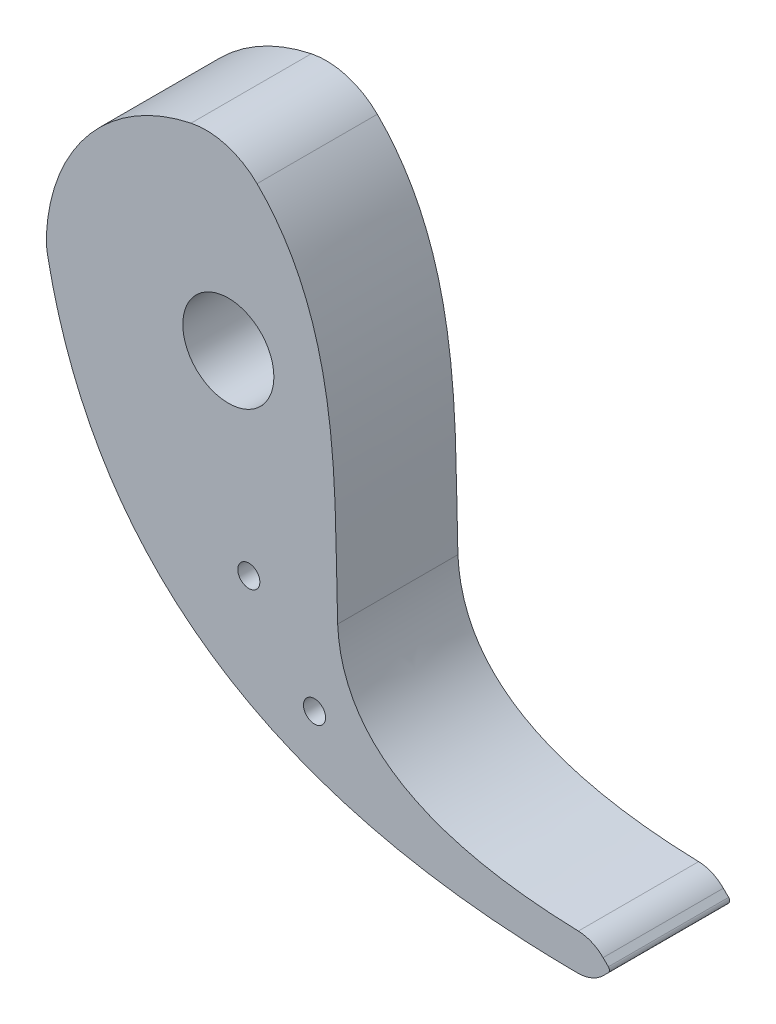
ISO-10303-21;
HEADER;
FILE_DESCRIPTION(('STEP AP214'),'2;1');
FILE_NAME('part.step','',(''),(''),'','','');
FILE_SCHEMA(('AUTOMOTIVE_DESIGN { 1 0 10303 214 1 1 1 1 }'));
ENDSEC;
DATA;
#1=APPLICATION_CONTEXT('core data for automotive mechanical design processes');
#2=APPLICATION_PROTOCOL_DEFINITION('international standard','automotive_design',2000,#1);
#3=PRODUCT_CONTEXT('',#1,'mechanical');
#4=PRODUCT('Part','Part','',(#3));
#5=PRODUCT_RELATED_PRODUCT_CATEGORY('part','',(#4));
#6=PRODUCT_DEFINITION_FORMATION('','',#4);
#7=PRODUCT_DEFINITION_CONTEXT('part definition',#1,'design');
#8=PRODUCT_DEFINITION('design','',#6,#7);
#9=PRODUCT_DEFINITION_SHAPE('','',#8);
#10=(LENGTH_UNIT() NAMED_UNIT(*) SI_UNIT(.MILLI.,.METRE.));
#11=(NAMED_UNIT(*) PLANE_ANGLE_UNIT() SI_UNIT($,.RADIAN.));
#12=(NAMED_UNIT(*) SI_UNIT($,.STERADIAN.) SOLID_ANGLE_UNIT());
#13=UNCERTAINTY_MEASURE_WITH_UNIT(LENGTH_MEASURE(1.E-05),#10,'distance_accuracy_value','');
#14=(GEOMETRIC_REPRESENTATION_CONTEXT(3) GLOBAL_UNCERTAINTY_ASSIGNED_CONTEXT((#13)) GLOBAL_UNIT_ASSIGNED_CONTEXT((#10,
#11,#12)) REPRESENTATION_CONTEXT('',''));
#15=CARTESIAN_POINT('',(0.,0.,0.));
#16=DIRECTION('',(0.,0.,1.));
#17=DIRECTION('',(1.,0.,0.));
#18=AXIS2_PLACEMENT_3D('',#15,#16,#17);
#19=CARTESIAN_POINT('',(96.0614321255408,-89.9222344491999,100.));
#20=CARTESIAN_POINT('',(74.6396324890567,-89.3105921557209,100.));
#21=CARTESIAN_POINT('',(42.207594165123,-82.0452441207387,100.));
#22=CARTESIAN_POINT('',(30.5986777387312,-62.6957691895991,100.));
#23=CARTESIAN_POINT('',(30.,-50.,100.));
#24=B_SPLINE_CURVE_WITH_KNOTS('',3,(#19,#20,#21,#22,#23),.UNSPECIFIED.,.F.,.F.,(4,1,4),
(0.0277647284146162,0.487449893921152,0.947135059427687),.UNSPECIFIED.);
#25=DIRECTION('',(0.,0.,-1.));
#26=VECTOR('',#25,1.);
#27=SURFACE_OF_LINEAR_EXTRUSION('',#24,#26);
#28=DIRECTION('',(0.,0.,-1.));
#29=VECTOR('',#28,1.);
#30=CARTESIAN_POINT('',(96.0614321255408,-89.9222344491999,100.));
#31=LINE('',#30,#29);
#32=CARTESIAN_POINT('',(96.0614321255408,-89.9222344491999,100.));
#33=VERTEX_POINT('',#32);
#34=CARTESIAN_POINT('',(96.0614321255408,-89.9222344491999,67.));
#35=VERTEX_POINT('',#34);
#36=EDGE_CURVE('E142',#33,#35,#31,.T.);
#37=ORIENTED_EDGE('',*,*,#36,.T.);
#38=CARTESIAN_POINT('',(96.0614321255408,-89.9222344491999,67.));
#39=CARTESIAN_POINT('',(74.6396324890567,-89.3105921557209,67.));
#40=CARTESIAN_POINT('',(42.207594165123,-82.0452441207387,67.));
#41=CARTESIAN_POINT('',(30.5986777387312,-62.6957691895991,67.));
#42=CARTESIAN_POINT('',(30.,-50.,67.));
#43=B_SPLINE_CURVE_WITH_KNOTS('',3,(#38,#39,#40,#41,#42),.UNSPECIFIED.,.F.,.F.,(4,1,4),
(0.0277647284146162,0.487449893921152,0.947135059427687),.UNSPECIFIED.);
#44=CARTESIAN_POINT('',(30.,-50.,67.));
#45=VERTEX_POINT('',#44);
#46=EDGE_CURVE('E54',#35,#45,#43,.T.);
#47=ORIENTED_EDGE('',*,*,#46,.T.);
#48=DIRECTION('',(0.,0.,-1.));
#49=VECTOR('',#48,1.);
#50=CARTESIAN_POINT('',(30.,-50.,100.));
#51=LINE('',#50,#49);
#52=CARTESIAN_POINT('',(30.,-50.,100.));
#53=VERTEX_POINT('',#52);
#54=EDGE_CURVE('E11',#53,#45,#51,.T.);
#55=ORIENTED_EDGE('',*,*,#54,.F.);
#56=EDGE_CURVE('E218',#33,#53,#24,.T.);
#57=ORIENTED_EDGE('',*,*,#56,.F.);
#58=EDGE_LOOP('',(#37,#47,#55,#57));
#59=FACE_BOUND('',#58,.T.);
#60=ADVANCED_FACE('F37',(#59),#27,.F.);
#61=CARTESIAN_POINT('',(30.,-50.,100.));
#62=CARTESIAN_POINT('',(29.0655778584205,-23.9165926404982,100.));
#63=CARTESIAN_POINT('',(31.4518831291268,15.3536689120195,100.));
#64=CARTESIAN_POINT('',(10.553539900454,41.0011969030345,100.));
#65=CARTESIAN_POINT('',(7.88775097032687,43.6234763854406,100.));
#66=B_SPLINE_CURVE_WITH_KNOTS('',3,(#61,#62,#63,#64,#65),.UNSPECIFIED.,.F.,.F.,(4,1,4),(0.,
0.805376888640356,0.908560602925233),.UNSPECIFIED.);
#67=DIRECTION('',(0.,0.,-1.));
#68=VECTOR('',#67,1.);
#69=SURFACE_OF_LINEAR_EXTRUSION('',#66,#68);
#70=ORIENTED_EDGE('',*,*,#54,.T.);
#71=CARTESIAN_POINT('',(30.,-50.,67.));
#72=CARTESIAN_POINT('',(29.0655778584205,-23.9165926404982,67.));
#73=CARTESIAN_POINT('',(31.4518831291268,15.3536689120195,67.));
#74=CARTESIAN_POINT('',(10.553539900454,41.0011969030345,67.));
#75=CARTESIAN_POINT('',(7.88775097032687,43.6234763854406,67.));
#76=B_SPLINE_CURVE_WITH_KNOTS('',3,(#71,#72,#73,#74,#75),.UNSPECIFIED.,.F.,.F.,(4,1,4),(0.,
0.805376888640356,0.908560602925233),.UNSPECIFIED.);
#77=CARTESIAN_POINT('',(7.88775097032688,43.6234763854406,67.));
#78=VERTEX_POINT('',#77);
#79=EDGE_CURVE('E189',#45,#78,#76,.T.);
#80=ORIENTED_EDGE('',*,*,#79,.T.);
#81=DIRECTION('',(0.,0.,-1.));
#82=VECTOR('',#81,1.);
#83=CARTESIAN_POINT('',(7.88775097032687,43.6234763854406,100.));
#84=LINE('',#83,#82);
#85=CARTESIAN_POINT('',(7.88775097032687,43.6234763854406,100.));
#86=VERTEX_POINT('',#85);
#87=EDGE_CURVE('E47',#86,#78,#84,.T.);
#88=ORIENTED_EDGE('',*,*,#87,.F.);
#89=EDGE_CURVE('E188',#53,#86,#66,.T.);
#90=ORIENTED_EDGE('',*,*,#89,.F.);
#91=EDGE_LOOP('',(#70,#80,#88,#90));
#92=FACE_BOUND('',#91,.T.);
#93=ADVANCED_FACE('F187',(#92),#69,.F.);
#94=CARTESIAN_POINT('',(-6.13755051397834,29.3654639617419,100.));
#95=DIRECTION('',(0.,0.,-1.));
#96=DIRECTION('',(-1.,0.,0.));
#97=AXIS2_PLACEMENT_3D('',#94,#95,#96);
#98=CYLINDRICAL_SURFACE('',#97,20.);
#99=ORIENTED_EDGE('',*,*,#87,.T.);
#100=CARTESIAN_POINT('',(-6.13755051397834,29.3654639617419,67.));
#101=DIRECTION('',(0.,0.,1.));
#102=DIRECTION('',(1.,0.,0.));
#103=AXIS2_PLACEMENT_3D('',#100,#101,#102);
#104=CIRCLE('',#103,20.);
#105=CARTESIAN_POINT('',(-10.2292508566306,48.9424399362366,67.));
#106=VERTEX_POINT('',#105);
#107=EDGE_CURVE('E183',#78,#106,#104,.T.);
#108=ORIENTED_EDGE('',*,*,#107,.T.);
#109=DIRECTION('',(0.,0.,-1.));
#110=VECTOR('',#109,1.);
#111=CARTESIAN_POINT('',(-10.2292508566306,48.9424399362366,100.));
#112=LINE('',#111,#110);
#113=CARTESIAN_POINT('',(-10.2292508566306,48.9424399362366,100.));
#114=VERTEX_POINT('',#113);
#115=EDGE_CURVE('E170',#114,#106,#112,.T.);
#116=ORIENTED_EDGE('',*,*,#115,.F.);
#117=CARTESIAN_POINT('',(-6.13755051397834,29.3654639617419,100.));
#118=DIRECTION('',(0.,0.,1.));
#119=DIRECTION('',(1.,0.,0.));
#120=AXIS2_PLACEMENT_3D('',#117,#118,#119);
#121=CIRCLE('',#120,20.);
#122=EDGE_CURVE('E184',#86,#114,#121,.T.);
#123=ORIENTED_EDGE('',*,*,#122,.F.);
#124=EDGE_LOOP('',(#99,#108,#116,#123));
#125=FACE_BOUND('',#124,.T.);
#126=ADVANCED_FACE('F181',(#125),#98,.T.);
#127=CARTESIAN_POINT('',(0.,0.,100.));
#128=DIRECTION('',(0.,0.,-1.));
#129=DIRECTION('',(-1.,0.,0.));
#130=AXIS2_PLACEMENT_3D('',#127,#128,#129);
#131=CYLINDRICAL_SURFACE('',#130,50.);
#132=ORIENTED_EDGE('',*,*,#115,.T.);
#133=CARTESIAN_POINT('',(0.,0.,67.));
#134=DIRECTION('',(0.,0.,1.));
#135=DIRECTION('',(1.,0.,0.));
#136=AXIS2_PLACEMENT_3D('',#133,#134,#135);
#137=CIRCLE('',#136,50.);
#138=CARTESIAN_POINT('',(-49.9267220496655,2.70599803685169,67.));
#139=VERTEX_POINT('',#138);
#140=EDGE_CURVE('E194',#106,#139,#137,.T.);
#141=ORIENTED_EDGE('',*,*,#140,.T.);
#142=DIRECTION('',(0.,0.,-1.));
#143=VECTOR('',#142,1.);
#144=CARTESIAN_POINT('',(-49.9267220496655,2.70599803685169,100.));
#145=LINE('',#144,#143);
#146=CARTESIAN_POINT('',(-49.9267220496655,2.70599803685169,100.));
#147=VERTEX_POINT('',#146);
#148=EDGE_CURVE('E166',#147,#139,#145,.T.);
#149=ORIENTED_EDGE('',*,*,#148,.F.);
#150=CARTESIAN_POINT('',(0.,0.,100.));
#151=DIRECTION('',(0.,0.,1.));
#152=DIRECTION('',(1.,0.,0.));
#153=AXIS2_PLACEMENT_3D('',#150,#151,#152);
#154=CIRCLE('',#153,50.);
#155=EDGE_CURVE('E278',#114,#147,#154,.T.);
#156=ORIENTED_EDGE('',*,*,#155,.F.);
#157=EDGE_LOOP('',(#132,#141,#149,#156));
#158=FACE_BOUND('',#157,.T.);
#159=ADVANCED_FACE('F240',(#158),#131,.T.);
#160=CARTESIAN_POINT('',(-29.9560332297993,1.62359882211103,100.));
#161=DIRECTION('',(0.,0.,-1.));
#162=DIRECTION('',(-1.,0.,0.));
#163=AXIS2_PLACEMENT_3D('',#160,#161,#162);
#164=CYLINDRICAL_SURFACE('',#163,20.);
#165=ORIENTED_EDGE('',*,*,#148,.T.);
#166=CARTESIAN_POINT('',(-29.9560332297993,1.62359882211103,67.));
#167=DIRECTION('',(0.,0.,1.));
#168=DIRECTION('',(1.,0.,0.));
#169=AXIS2_PLACEMENT_3D('',#166,#167,#168);
#170=CIRCLE('',#169,20.);
#171=CARTESIAN_POINT('',(-49.5860072797543,-2.20577694922467,67.));
#172=VERTEX_POINT('',#171);
#173=EDGE_CURVE('E289',#139,#172,#170,.T.);
#174=ORIENTED_EDGE('',*,*,#173,.T.);
#175=DIRECTION('',(0.,0.,-1.));
#176=VECTOR('',#175,1.);
#177=CARTESIAN_POINT('',(-49.5860072797543,-2.20577694922468,100.));
#178=LINE('',#177,#176);
#179=CARTESIAN_POINT('',(-49.5860072797543,-2.20577694922468,100.));
#180=VERTEX_POINT('',#179);
#181=EDGE_CURVE('E163',#180,#172,#178,.T.);
#182=ORIENTED_EDGE('',*,*,#181,.F.);
#183=CARTESIAN_POINT('',(-29.9560332297993,1.62359882211103,100.));
#184=DIRECTION('',(0.,0.,1.));
#185=DIRECTION('',(-1.,0.,0.));
#186=AXIS2_PLACEMENT_3D('',#183,#184,#185);
#187=CIRCLE('',#186,20.);
#188=EDGE_CURVE('E263',#147,#180,#187,.T.);
#189=ORIENTED_EDGE('',*,*,#188,.F.);
#190=EDGE_LOOP('',(#165,#174,#182,#189));
#191=FACE_BOUND('',#190,.T.);
#192=ADVANCED_FACE('F243',(#191),#164,.T.);
#193=CARTESIAN_POINT('',(-49.5860072797543,-2.20577694922467,100.));
#194=CARTESIAN_POINT('',(-47.0447095065424,-15.2328634302042,100.));
#195=CARTESIAN_POINT('',(-27.0452536153668,-73.5633104074933,100.));
#196=CARTESIAN_POINT('',(28.6366700505365,-99.6569197690937,100.));
#197=CARTESIAN_POINT('',(95.8012423090635,-100.004707302185,100.));
#198=B_SPLINE_CURVE_WITH_KNOTS('',3,(#193,#194,#195,#196,#197),.UNSPECIFIED.,.F.,.F.,(4,1,4),
(0.0110398117893649,0.207725041354784,0.983937689400536),.UNSPECIFIED.);
#199=DIRECTION('',(0.,0.,-1.));
#200=VECTOR('',#199,1.);
#201=SURFACE_OF_LINEAR_EXTRUSION('',#198,#200);
#202=ORIENTED_EDGE('',*,*,#181,.T.);
#203=CARTESIAN_POINT('',(-49.5860072797543,-2.20577694922467,67.));
#204=CARTESIAN_POINT('',(-47.0447095065424,-15.2328634302042,67.));
#205=CARTESIAN_POINT('',(-27.0452536153668,-73.5633104074933,67.));
#206=CARTESIAN_POINT('',(28.6366700505365,-99.6569197690937,67.));
#207=CARTESIAN_POINT('',(95.8012423090635,-100.004707302185,67.));
#208=B_SPLINE_CURVE_WITH_KNOTS('',3,(#203,#204,#205,#206,#207),.UNSPECIFIED.,.F.,.F.,(4,1,4),
(0.0110398117893649,0.207725041354784,0.983937689400536),.UNSPECIFIED.);
#209=CARTESIAN_POINT('',(95.8012423090635,-100.004707302185,67.));
#210=VERTEX_POINT('',#209);
#211=EDGE_CURVE('E292',#172,#210,#208,.T.);
#212=ORIENTED_EDGE('',*,*,#211,.T.);
#213=DIRECTION('',(0.,0.,-1.));
#214=VECTOR('',#213,1.);
#215=CARTESIAN_POINT('',(95.8012423090635,-100.004707302185,100.));
#216=LINE('',#215,#214);
#217=CARTESIAN_POINT('',(95.8012423090635,-100.004707302185,100.));
#218=VERTEX_POINT('',#217);
#219=EDGE_CURVE('E159',#218,#210,#216,.T.);
#220=ORIENTED_EDGE('',*,*,#219,.F.);
#221=EDGE_CURVE('E255',#180,#218,#198,.T.);
#222=ORIENTED_EDGE('',*,*,#221,.F.);
#223=EDGE_LOOP('',(#202,#212,#220,#222));
#224=FACE_BOUND('',#223,.T.);
#225=ADVANCED_FACE('F247',(#224),#201,.F.);
#226=CARTESIAN_POINT('',(95.8530230111228,-90.0048413651389,100.));
#227=DIRECTION('',(0.,0.,-1.));
#228=DIRECTION('',(-1.,0.,0.));
#229=AXIS2_PLACEMENT_3D('',#226,#227,#228);
#230=CYLINDRICAL_SURFACE('',#229,10.);
#231=ORIENTED_EDGE('',*,*,#219,.T.);
#232=CARTESIAN_POINT('',(95.8530230111228,-90.0048413651389,67.));
#233=DIRECTION('',(0.,0.,1.));
#234=DIRECTION('',(1.,0.,0.));
#235=AXIS2_PLACEMENT_3D('',#232,#233,#234);
#236=CIRCLE('',#235,10.);
#237=CARTESIAN_POINT('',(102.924090822988,-97.0759091770044,67.));
#238=VERTEX_POINT('',#237);
#239=EDGE_CURVE('E306',#210,#238,#236,.T.);
#240=ORIENTED_EDGE('',*,*,#239,.T.);
#241=DIRECTION('',(0.,0.,-1.));
#242=VECTOR('',#241,1.);
#243=CARTESIAN_POINT('',(102.924090822988,-97.0759091770044,100.));
#244=LINE('',#243,#242);
#245=CARTESIAN_POINT('',(102.924090822988,-97.0759091770044,100.));
#246=VERTEX_POINT('',#245);
#247=EDGE_CURVE('E155',#246,#238,#244,.T.);
#248=ORIENTED_EDGE('',*,*,#247,.F.);
#249=CARTESIAN_POINT('',(95.8530230111228,-90.0048413651389,100.));
#250=DIRECTION('',(0.,0.,1.));
#251=DIRECTION('',(-1.,0.,0.));
#252=AXIS2_PLACEMENT_3D('',#249,#250,#251);
#253=CIRCLE('',#252,10.);
#254=EDGE_CURVE('E262',#218,#246,#253,.T.);
#255=ORIENTED_EDGE('',*,*,#254,.F.);
#256=EDGE_LOOP('',(#231,#240,#248,#255));
#257=FACE_BOUND('',#256,.T.);
#258=ADVANCED_FACE('F252',(#257),#230,.T.);
#259=CARTESIAN_POINT('',(102.924090822988,-97.0759091770044,100.));
#260=DIRECTION('',(-0.707106781186551,0.707106781186544,0.));
#261=DIRECTION('',(-0.707106781186544,-0.707106781186551,0.));
#262=AXIS2_PLACEMENT_3D('',#259,#260,#261);
#263=PLANE('',#262);
#264=ORIENTED_EDGE('',*,*,#247,.T.);
#265=DIRECTION('',(0.707106781186544,0.707106781186551,0.));
#266=VECTOR('',#265,1.);
#267=CARTESIAN_POINT('',(102.924090822988,-97.0759091770044,67.));
#268=LINE('',#267,#266);
#269=CARTESIAN_POINT('',(104.29289321881,-95.7071067811829,67.));
#270=VERTEX_POINT('',#269);
#271=EDGE_CURVE('E302',#238,#270,#268,.T.);
#272=ORIENTED_EDGE('',*,*,#271,.T.);
#273=DIRECTION('',(0.,0.,-1.));
#274=VECTOR('',#273,1.);
#275=CARTESIAN_POINT('',(104.29289321881,-95.7071067811829,100.));
#276=LINE('',#275,#274);
#277=CARTESIAN_POINT('',(104.29289321881,-95.7071067811829,100.));
#278=VERTEX_POINT('',#277);
#279=EDGE_CURVE('E146',#278,#270,#276,.T.);
#280=ORIENTED_EDGE('',*,*,#279,.F.);
#281=DIRECTION('',(0.707106781186544,0.707106781186551,0.));
#282=VECTOR('',#281,1.);
#283=CARTESIAN_POINT('',(102.924090822988,-97.0759091770044,100.));
#284=LINE('',#283,#282);
#285=EDGE_CURVE('E268',#246,#278,#284,.T.);
#286=ORIENTED_EDGE('',*,*,#285,.F.);
#287=EDGE_LOOP('',(#264,#272,#280,#286));
#288=FACE_BOUND('',#287,.T.);
#289=ADVANCED_FACE('F301',(#288),#263,.F.);
#290=CARTESIAN_POINT('',(103.585786437623,-94.9999999999963,100.));
#291=DIRECTION('',(0.,0.,-1.));
#292=DIRECTION('',(-1.,0.,0.));
#293=AXIS2_PLACEMENT_3D('',#290,#291,#292);
#294=CYLINDRICAL_SURFACE('',#293,0.999999999999997);
#295=ORIENTED_EDGE('',*,*,#279,.T.);
#296=CARTESIAN_POINT('',(103.585786437623,-94.9999999999963,67.));
#297=DIRECTION('',(0.,0.,1.));
#298=DIRECTION('',(1.,0.,0.));
#299=AXIS2_PLACEMENT_3D('',#296,#297,#298);
#300=CIRCLE('',#299,0.999999999999997);
#301=CARTESIAN_POINT('',(104.29289321881,-94.2928932188098,67.));
#302=VERTEX_POINT('',#301);
#303=EDGE_CURVE('E138',#270,#302,#300,.T.);
#304=ORIENTED_EDGE('',*,*,#303,.T.);
#305=DIRECTION('',(0.,0.,-1.));
#306=VECTOR('',#305,1.);
#307=CARTESIAN_POINT('',(104.29289321881,-94.2928932188098,100.));
#308=LINE('',#307,#306);
#309=CARTESIAN_POINT('',(104.29289321881,-94.2928932188098,100.));
#310=VERTEX_POINT('',#309);
#311=EDGE_CURVE('E137',#310,#302,#308,.T.);
#312=ORIENTED_EDGE('',*,*,#311,.F.);
#313=CARTESIAN_POINT('',(103.585786437623,-94.9999999999963,100.));
#314=DIRECTION('',(0.,0.,1.));
#315=DIRECTION('',(-1.,0.,0.));
#316=AXIS2_PLACEMENT_3D('',#313,#314,#315);
#317=CIRCLE('',#316,0.999999999999997);
#318=EDGE_CURVE('E271',#278,#310,#317,.T.);
#319=ORIENTED_EDGE('',*,*,#318,.F.);
#320=EDGE_LOOP('',(#295,#304,#312,#319));
#321=FACE_BOUND('',#320,.T.);
#322=ADVANCED_FACE('F304',(#321),#294,.T.);
#323=CARTESIAN_POINT('',(102.84709295017,-92.8470929501699,100.));
#324=DIRECTION('',(-0.707106781186548,-0.707106781186548,0.));
#325=DIRECTION('',(0.707106781186548,-0.707106781186548,0.));
#326=AXIS2_PLACEMENT_3D('',#323,#324,#325);
#327=PLANE('',#326);
#328=ORIENTED_EDGE('',*,*,#311,.T.);
#329=DIRECTION('',(-0.707106781186548,0.707106781186548,0.));
#330=VECTOR('',#329,1.);
#331=CARTESIAN_POINT('',(102.84709295017,-92.8470929501699,67.));
#332=LINE('',#331,#330);
#333=CARTESIAN_POINT('',(102.84709295017,-92.8470929501699,67.));
#334=VERTEX_POINT('',#333);
#335=EDGE_CURVE('E123',#302,#334,#332,.T.);
#336=ORIENTED_EDGE('',*,*,#335,.T.);
#337=DIRECTION('',(0.,0.,-1.));
#338=VECTOR('',#337,1.);
#339=CARTESIAN_POINT('',(102.84709295017,-92.8470929501699,100.));
#340=LINE('',#339,#338);
#341=CARTESIAN_POINT('',(102.84709295017,-92.8470929501699,100.));
#342=VERTEX_POINT('',#341);
#343=EDGE_CURVE('E135',#342,#334,#340,.T.);
#344=ORIENTED_EDGE('',*,*,#343,.F.);
#345=DIRECTION('',(-0.707106781186548,0.707106781186548,0.));
#346=VECTOR('',#345,1.);
#347=CARTESIAN_POINT('',(102.84709295017,-92.8470929501699,100.));
#348=LINE('',#347,#346);
#349=EDGE_CURVE('E274',#310,#342,#348,.T.);
#350=ORIENTED_EDGE('',*,*,#349,.F.);
#351=EDGE_LOOP('',(#328,#336,#344,#350));
#352=FACE_BOUND('',#351,.T.);
#353=ADVANCED_FACE('F133',(#352),#327,.F.);
#354=CARTESIAN_POINT('',(95.7760251383045,-99.9181607620354,100.));
#355=DIRECTION('',(0.,0.,-1.));
#356=DIRECTION('',(-1.,0.,0.));
#357=AXIS2_PLACEMENT_3D('',#354,#355,#356);
#358=CYLINDRICAL_SURFACE('',#357,10.);
#359=ORIENTED_EDGE('',*,*,#343,.T.);
#360=CARTESIAN_POINT('',(95.7760251383045,-99.9181607620354,67.));
#361=DIRECTION('',(0.,0.,1.));
#362=DIRECTION('',(1.,0.,0.));
#363=AXIS2_PLACEMENT_3D('',#360,#361,#362);
#364=CIRCLE('',#363,10.);
#365=EDGE_CURVE('E120',#334,#35,#364,.T.);
#366=ORIENTED_EDGE('',*,*,#365,.T.);
#367=ORIENTED_EDGE('',*,*,#36,.F.);
#368=CARTESIAN_POINT('',(95.7760251383045,-99.9181607620354,100.));
#369=DIRECTION('',(0.,0.,1.));
#370=DIRECTION('',(1.,0.,0.));
#371=AXIS2_PLACEMENT_3D('',#368,#369,#370);
#372=CIRCLE('',#371,10.);
#373=EDGE_CURVE('E62',#342,#33,#372,.T.);
#374=ORIENTED_EDGE('',*,*,#373,.F.);
#375=EDGE_LOOP('',(#359,#366,#367,#374));
#376=FACE_BOUND('',#375,.T.);
#377=ADVANCED_FACE('F140',(#376),#358,.T.);
#378=CARTESIAN_POINT('',(47.4133746395084,-79.0242123966994,100.));
#379=DIRECTION('',(0.,0.,1.));
#380=DIRECTION('',(1.,0.,0.));
#381=AXIS2_PLACEMENT_3D('',#378,#379,#380);
#382=PLANE('',#381);
#383=CARTESIAN_POINT('',(0.,0.,100.));
#384=DIRECTION('',(0.,0.,1.));
#385=DIRECTION('',(1.,0.,0.));
#386=AXIS2_PLACEMENT_3D('',#383,#384,#385);
#387=CIRCLE('',#386,12.5);
#388=CARTESIAN_POINT('',(12.5,0.,100.));
#389=VERTEX_POINT('',#388);
#390=EDGE_CURVE('E192',#389,#389,#387,.T.);
#391=ORIENTED_EDGE('',*,*,#390,.F.);
#392=EDGE_LOOP('',(#391));
#393=FACE_BOUND('',#392,.T.);
#394=CARTESIAN_POINT('',(5.62196341020624,-50.7014980743151,100.));
#395=DIRECTION('',(0.,0.,1.));
#396=DIRECTION('',(1.,0.,0.));
#397=AXIS2_PLACEMENT_3D('',#394,#395,#396);
#398=CIRCLE('',#397,3.03);
#399=CARTESIAN_POINT('',(8.64878671915177,-50.8402087675728,100.));
#400=VERTEX_POINT('',#399);
#401=EDGE_CURVE('E215',#400,#400,#398,.F.);
#402=ORIENTED_EDGE('',*,*,#401,.T.);
#403=EDGE_LOOP('',(#402));
#404=FACE_BOUND('',#403,.T.);
#405=CARTESIAN_POINT('',(23.6513180824392,-73.9138117802538,100.));
#406=DIRECTION('',(0.,0.,1.));
#407=DIRECTION('',(1.,0.,0.));
#408=AXIS2_PLACEMENT_3D('',#405,#406,#407);
#409=CIRCLE('',#408,3.03);
#410=CARTESIAN_POINT('',(26.6813180824392,-73.9138117802538,100.));
#411=VERTEX_POINT('',#410);
#412=EDGE_CURVE('E211',#411,#411,#409,.F.);
#413=ORIENTED_EDGE('',*,*,#412,.T.);
#414=EDGE_LOOP('',(#413));
#415=FACE_BOUND('',#414,.T.);
#416=ORIENTED_EDGE('',*,*,#56,.T.);
#417=ORIENTED_EDGE('',*,*,#89,.T.);
#418=ORIENTED_EDGE('',*,*,#122,.T.);
#419=ORIENTED_EDGE('',*,*,#155,.T.);
#420=ORIENTED_EDGE('',*,*,#188,.T.);
#421=ORIENTED_EDGE('',*,*,#221,.T.);
#422=ORIENTED_EDGE('',*,*,#254,.T.);
#423=ORIENTED_EDGE('',*,*,#285,.T.);
#424=ORIENTED_EDGE('',*,*,#318,.T.);
#425=ORIENTED_EDGE('',*,*,#349,.T.);
#426=ORIENTED_EDGE('',*,*,#373,.T.);
#427=EDGE_LOOP('',(#416,#417,#418,#419,#420,#421,#422,#423,#424,#425,#426));
#428=FACE_BOUND('',#427,.T.);
#429=ADVANCED_FACE('F285',(#393,#404,#415,#428),#382,.T.);
#430=CARTESIAN_POINT('',(23.6513180824392,-73.9138117802538,29.6340844617728));
#431=DIRECTION('',(0.,0.,1.));
#432=DIRECTION('',(0.96066085551831,0.277724180932861,0.));
#433=AXIS2_PLACEMENT_3D('',#430,#431,#432);
#434=CYLINDRICAL_SURFACE('',#433,3.03);
#435=CARTESIAN_POINT('',(23.6513180824392,-73.9138117802538,67.));
#436=DIRECTION('',(0.,0.,1.));
#437=DIRECTION('',(1.,0.,0.));
#438=AXIS2_PLACEMENT_3D('',#435,#436,#437);
#439=CIRCLE('',#438,3.03);
#440=CARTESIAN_POINT('',(26.6813180824392,-73.9138117802538,67.));
#441=VERTEX_POINT('',#440);
#442=EDGE_CURVE('E128',#441,#441,#439,.T.);
#443=ORIENTED_EDGE('',*,*,#442,.F.);
#444=EDGE_LOOP('',(#443));
#445=FACE_BOUND('',#444,.T.);
#446=ORIENTED_EDGE('',*,*,#412,.F.);
#447=EDGE_LOOP('',(#446));
#448=FACE_BOUND('',#447,.T.);
#449=ADVANCED_FACE('F335',(#445,#448),#434,.F.);
#450=CARTESIAN_POINT('',(5.62196341020624,-50.7014980743151,29.6340844617728));
#451=DIRECTION('',(0.,0.,1.));
#452=DIRECTION('',(0.998951587110736,-0.04577910668572,0.));
#453=AXIS2_PLACEMENT_3D('',#450,#451,#452);
#454=CYLINDRICAL_SURFACE('',#453,3.03);
#455=CARTESIAN_POINT('',(5.62196341020624,-50.7014980743151,67.));
#456=DIRECTION('',(0.,0.,1.));
#457=DIRECTION('',(1.,0.,0.));
#458=AXIS2_PLACEMENT_3D('',#455,#456,#457);
#459=CIRCLE('',#458,3.03);
#460=CARTESIAN_POINT('',(8.64878671915177,-50.8402087675728,67.));
#461=VERTEX_POINT('',#460);
#462=EDGE_CURVE('E320',#461,#461,#459,.T.);
#463=CARTESIAN_POINT('',(8.64878671915177,-50.8402087675728,67.));
#464=CARTESIAN_POINT('',(8.64878671915177,-50.8402087675728,67.34375));
#465=CARTESIAN_POINT('',(8.64878671915177,-50.8402087675728,67.6875));
#466=CARTESIAN_POINT('',(8.64878671915177,-50.8402087675728,68.375));
#467=CARTESIAN_POINT('',(8.64878671915177,-50.8402087675728,68.71875));
#468=CARTESIAN_POINT('',(8.64878671915177,-50.8402087675728,69.40625));
#469=CARTESIAN_POINT('',(8.64878671915177,-50.8402087675728,69.75));
#470=CARTESIAN_POINT('',(8.64878671915177,-50.8402087675728,70.4375));
#471=CARTESIAN_POINT('',(8.64878671915177,-50.8402087675728,70.78125));
#472=CARTESIAN_POINT('',(8.64878671915177,-50.8402087675728,71.46875));
#473=CARTESIAN_POINT('',(8.64878671915177,-50.8402087675728,71.8125));
#474=CARTESIAN_POINT('',(8.64878671915177,-50.8402087675728,72.5));
#475=CARTESIAN_POINT('',(8.64878671915177,-50.8402087675728,72.84375));
#476=CARTESIAN_POINT('',(8.64878671915177,-50.8402087675728,73.53125));
#477=CARTESIAN_POINT('',(8.64878671915177,-50.8402087675728,73.875));
#478=CARTESIAN_POINT('',(8.64878671915177,-50.8402087675728,74.5625));
#479=CARTESIAN_POINT('',(8.64878671915177,-50.8402087675728,74.90625));
#480=CARTESIAN_POINT('',(8.64878671915177,-50.8402087675728,75.59375));
#481=CARTESIAN_POINT('',(8.64878671915177,-50.8402087675728,75.9375));
#482=CARTESIAN_POINT('',(8.64878671915177,-50.8402087675728,76.625));
#483=CARTESIAN_POINT('',(8.64878671915177,-50.8402087675728,76.96875));
#484=CARTESIAN_POINT('',(8.64878671915177,-50.8402087675728,77.65625));
#485=CARTESIAN_POINT('',(8.64878671915177,-50.8402087675728,78.));
#486=CARTESIAN_POINT('',(8.64878671915177,-50.8402087675728,78.6875));
#487=CARTESIAN_POINT('',(8.64878671915177,-50.8402087675728,79.03125));
#488=CARTESIAN_POINT('',(8.64878671915177,-50.8402087675728,79.71875));
#489=CARTESIAN_POINT('',(8.64878671915177,-50.8402087675728,80.0625));
#490=CARTESIAN_POINT('',(8.64878671915177,-50.8402087675728,80.75));
#491=CARTESIAN_POINT('',(8.64878671915177,-50.8402087675728,81.09375));
#492=CARTESIAN_POINT('',(8.64878671915177,-50.8402087675728,81.78125));
#493=CARTESIAN_POINT('',(8.64878671915177,-50.8402087675728,82.125));
#494=CARTESIAN_POINT('',(8.64878671915177,-50.8402087675728,82.8125));
#495=CARTESIAN_POINT('',(8.64878671915177,-50.8402087675728,83.15625));
#496=CARTESIAN_POINT('',(8.64878671915177,-50.8402087675728,83.84375));
#497=CARTESIAN_POINT('',(8.64878671915177,-50.8402087675728,84.1875));
#498=CARTESIAN_POINT('',(8.64878671915177,-50.8402087675728,84.875));
#499=CARTESIAN_POINT('',(8.64878671915177,-50.8402087675728,85.21875));
#500=CARTESIAN_POINT('',(8.64878671915177,-50.8402087675728,85.90625));
#501=CARTESIAN_POINT('',(8.64878671915177,-50.8402087675728,86.25));
#502=CARTESIAN_POINT('',(8.64878671915177,-50.8402087675728,86.9375));
#503=CARTESIAN_POINT('',(8.64878671915177,-50.8402087675728,87.28125));
#504=CARTESIAN_POINT('',(8.64878671915177,-50.8402087675728,87.96875));
#505=CARTESIAN_POINT('',(8.64878671915177,-50.8402087675728,88.3125));
#506=CARTESIAN_POINT('',(8.64878671915177,-50.8402087675728,89.));
#507=CARTESIAN_POINT('',(8.64878671915177,-50.8402087675728,89.34375));
#508=CARTESIAN_POINT('',(8.64878671915177,-50.8402087675728,90.03125));
#509=CARTESIAN_POINT('',(8.64878671915177,-50.8402087675728,90.375));
#510=CARTESIAN_POINT('',(8.64878671915177,-50.8402087675728,91.0625));
#511=CARTESIAN_POINT('',(8.64878671915177,-50.8402087675728,91.40625));
#512=CARTESIAN_POINT('',(8.64878671915177,-50.8402087675728,92.09375));
#513=CARTESIAN_POINT('',(8.64878671915177,-50.8402087675728,92.4375));
#514=CARTESIAN_POINT('',(8.64878671915177,-50.8402087675728,93.125));
#515=CARTESIAN_POINT('',(8.64878671915177,-50.8402087675728,93.46875));
#516=CARTESIAN_POINT('',(8.64878671915177,-50.8402087675728,94.15625));
#517=CARTESIAN_POINT('',(8.64878671915177,-50.8402087675728,94.5));
#518=CARTESIAN_POINT('',(8.64878671915177,-50.8402087675728,95.1875));
#519=CARTESIAN_POINT('',(8.64878671915177,-50.8402087675728,95.53125));
#520=CARTESIAN_POINT('',(8.64878671915177,-50.8402087675728,96.21875));
#521=CARTESIAN_POINT('',(8.64878671915177,-50.8402087675728,96.5625));
#522=CARTESIAN_POINT('',(8.64878671915177,-50.8402087675728,97.25));
#523=CARTESIAN_POINT('',(8.64878671915177,-50.8402087675728,97.59375));
#524=CARTESIAN_POINT('',(8.64878671915177,-50.8402087675728,98.28125));
#525=CARTESIAN_POINT('',(8.64878671915177,-50.8402087675728,98.625));
#526=CARTESIAN_POINT('',(8.64878671915177,-50.8402087675728,99.3125));
#527=CARTESIAN_POINT('',(8.64878671915177,-50.8402087675728,99.65625));
#528=CARTESIAN_POINT('',(8.64878671915177,-50.8402087675728,100.));
#529=B_SPLINE_CURVE_WITH_KNOTS('',3,(#463,#464,#465,#466,#467,#468,#469,#470,#471,#472,#473,
#474,#475,#476,#477,#478,#479,#480,#481,#482,#483,#484,#485,#486,#487,#488,#489,#490,#491,#492,
#493,#494,#495,#496,#497,#498,#499,#500,#501,#502,#503,#504,#505,#506,#507,#508,#509,#510,#511,
#512,#513,#514,#515,#516,#517,#518,#519,#520,#521,#522,#523,#524,#525,#526,#527,#528),
.UNSPECIFIED.,.F.,.F.,(4,2,2,2,2,2,2,2,2,2,2,2,2,2,2,2,2,2,2,2,2,2,2,2,2,2,2,2,2,2,2,2,4),(0.,
1.03125,2.06250000000001,3.09374999999999,4.125,5.15625,6.1875,7.21875000000001,
8.25000000000001,9.28125000000001,10.3125,11.34375,12.375,13.40625,14.4375,15.46875,16.5,
17.53125,18.5625,19.59375,20.625,21.65625,22.6875,23.71875,24.75,25.78125,26.8125,27.84375,
28.875,29.90625,30.9375,31.96875,33.),.UNSPECIFIED.);
#530=EDGE_CURVE('BSEAM338',#461,#400,#529,.T.);
#531=ORIENTED_EDGE('',*,*,#462,.F.);
#532=ORIENTED_EDGE('',*,*,#401,.F.);
#533=ORIENTED_EDGE('',*,*,#530,.T.);
#534=ORIENTED_EDGE('',*,*,#530,.F.);
#535=EDGE_LOOP('',(#531,#533,#532,#534));
#536=FACE_BOUND('',#535,.T.);
#537=ADVANCED_FACE('F338',(#536),#454,.F.);
#538=CARTESIAN_POINT('',(0.,0.,-0.355339059327386));
#539=DIRECTION('',(0.,0.,1.));
#540=DIRECTION('',(1.,0.,0.));
#541=AXIS2_PLACEMENT_3D('',#538,#539,#540);
#542=CYLINDRICAL_SURFACE('',#541,12.5);
#543=CARTESIAN_POINT('',(0.,0.,67.));
#544=DIRECTION('',(0.,0.,1.));
#545=DIRECTION('',(1.,0.,0.));
#546=AXIS2_PLACEMENT_3D('',#543,#544,#545);
#547=CIRCLE('',#546,12.5);
#548=CARTESIAN_POINT('',(12.5,0.,67.));
#549=VERTEX_POINT('',#548);
#550=EDGE_CURVE('E41',#549,#549,#547,.F.);
#551=ORIENTED_EDGE('',*,*,#550,.T.);
#552=EDGE_LOOP('',(#551));
#553=FACE_BOUND('',#552,.T.);
#554=ORIENTED_EDGE('',*,*,#390,.T.);
#555=EDGE_LOOP('',(#554));
#556=FACE_BOUND('',#555,.T.);
#557=ADVANCED_FACE('F327',(#553,#556),#542,.F.);
#558=CARTESIAN_POINT('',(0.,0.,67.));
#559=DIRECTION('',(0.,0.,1.));
#560=DIRECTION('',(1.,0.,0.));
#561=AXIS2_PLACEMENT_3D('',#558,#559,#560);
#562=PLANE('',#561);
#563=ORIENTED_EDGE('',*,*,#550,.F.);
#564=EDGE_LOOP('',(#563));
#565=FACE_BOUND('',#564,.T.);
#566=ORIENTED_EDGE('',*,*,#462,.T.);
#567=EDGE_LOOP('',(#566));
#568=FACE_BOUND('',#567,.T.);
#569=ORIENTED_EDGE('',*,*,#442,.T.);
#570=EDGE_LOOP('',(#569));
#571=FACE_BOUND('',#570,.T.);
#572=ORIENTED_EDGE('',*,*,#365,.F.);
#573=ORIENTED_EDGE('',*,*,#335,.F.);
#574=ORIENTED_EDGE('',*,*,#303,.F.);
#575=ORIENTED_EDGE('',*,*,#271,.F.);
#576=ORIENTED_EDGE('',*,*,#239,.F.);
#577=ORIENTED_EDGE('',*,*,#211,.F.);
#578=ORIENTED_EDGE('',*,*,#173,.F.);
#579=ORIENTED_EDGE('',*,*,#140,.F.);
#580=ORIENTED_EDGE('',*,*,#107,.F.);
#581=ORIENTED_EDGE('',*,*,#79,.F.);
#582=ORIENTED_EDGE('',*,*,#46,.F.);
#583=EDGE_LOOP('',(#572,#573,#574,#575,#576,#577,#578,#579,#580,#581,#582));
#584=FACE_BOUND('',#583,.T.);
#585=ADVANCED_FACE('F122',(#565,#568,#571,#584),#562,.F.);
#586=CLOSED_SHELL('',(#60,#93,#126,#159,#192,#225,#258,#289,#322,#353,#377,#429,#449,#537,#557,#585));
#587=MANIFOLD_SOLID_BREP('B2',#586);
#588=ADVANCED_BREP_SHAPE_REPRESENTATION('',(#18,#587),#14);
#589=SHAPE_DEFINITION_REPRESENTATION(#9,#588);
ENDSEC;
END-ISO-10303-21;
